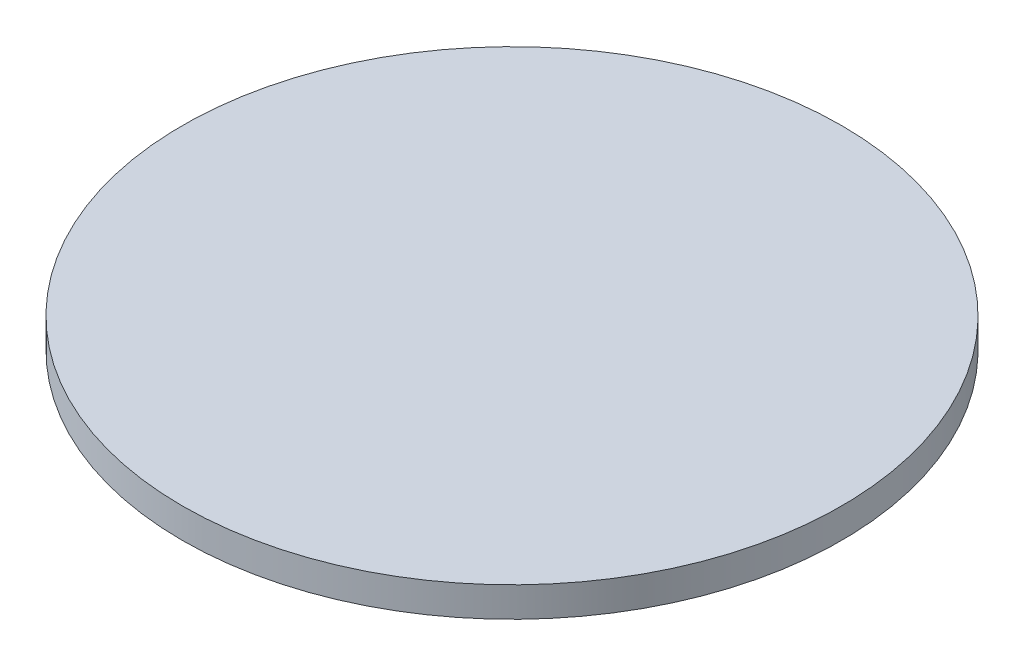
ISO-10303-21;
HEADER;
FILE_DESCRIPTION(('STEP AP214'),'2;1');
FILE_NAME('part.step','',(''),(''),'','','');
FILE_SCHEMA(('AUTOMOTIVE_DESIGN { 1 0 10303 214 1 1 1 1 }'));
ENDSEC;
DATA;
#1=APPLICATION_CONTEXT('core data for automotive mechanical design processes');
#2=APPLICATION_PROTOCOL_DEFINITION('international standard','automotive_design',2000,#1);
#3=PRODUCT_CONTEXT('',#1,'mechanical');
#4=PRODUCT('Part','Part','',(#3));
#5=PRODUCT_RELATED_PRODUCT_CATEGORY('part','',(#4));
#6=PRODUCT_DEFINITION_FORMATION('','',#4);
#7=PRODUCT_DEFINITION_CONTEXT('part definition',#1,'design');
#8=PRODUCT_DEFINITION('design','',#6,#7);
#9=PRODUCT_DEFINITION_SHAPE('','',#8);
#10=(LENGTH_UNIT() NAMED_UNIT(*) SI_UNIT(.MILLI.,.METRE.));
#11=(NAMED_UNIT(*) PLANE_ANGLE_UNIT() SI_UNIT($,.RADIAN.));
#12=(NAMED_UNIT(*) SI_UNIT($,.STERADIAN.) SOLID_ANGLE_UNIT());
#13=UNCERTAINTY_MEASURE_WITH_UNIT(LENGTH_MEASURE(1.E-05),#10,'distance_accuracy_value','');
#14=(GEOMETRIC_REPRESENTATION_CONTEXT(3) GLOBAL_UNCERTAINTY_ASSIGNED_CONTEXT((#13)) GLOBAL_UNIT_ASSIGNED_CONTEXT((#10,
#11,#12)) REPRESENTATION_CONTEXT('',''));
#15=CARTESIAN_POINT('',(0.,0.,0.));
#16=DIRECTION('',(0.,0.,1.));
#17=DIRECTION('',(1.,0.,0.));
#18=AXIS2_PLACEMENT_3D('',#15,#16,#17);
#19=CARTESIAN_POINT('',(0.,3.175,0.));
#20=DIRECTION('',(0.,-1.,0.));
#21=DIRECTION('',(0.,0.,-1.));
#22=AXIS2_PLACEMENT_3D('',#19,#20,#21);
#23=CYLINDRICAL_SURFACE('',#22,35.);
#24=CARTESIAN_POINT('',(0.,3.175,0.));
#25=DIRECTION('',(0.,1.,0.));
#26=DIRECTION('',(0.,0.,1.));
#27=AXIS2_PLACEMENT_3D('',#24,#25,#26);
#28=CIRCLE('',#27,35.);
#29=CARTESIAN_POINT('',(0.,3.175,35.));
#30=VERTEX_POINT('',#29);
#31=EDGE_CURVE('E10',#30,#30,#28,.T.);
#32=ORIENTED_EDGE('',*,*,#31,.F.);
#33=EDGE_LOOP('',(#32));
#34=FACE_BOUND('',#33,.T.);
#35=CARTESIAN_POINT('',(0.,0.,0.));
#36=DIRECTION('',(0.,1.,0.));
#37=DIRECTION('',(0.,0.,1.));
#38=AXIS2_PLACEMENT_3D('',#35,#36,#37);
#39=CIRCLE('',#38,35.);
#40=CARTESIAN_POINT('',(0.,0.,35.));
#41=VERTEX_POINT('',#40);
#42=EDGE_CURVE('E33',#41,#41,#39,.T.);
#43=ORIENTED_EDGE('',*,*,#42,.T.);
#44=EDGE_LOOP('',(#43));
#45=FACE_BOUND('',#44,.T.);
#46=ADVANCED_FACE('F30',(#34,#45),#23,.T.);
#47=CARTESIAN_POINT('',(0.,3.175,0.));
#48=DIRECTION('',(0.,1.,0.));
#49=DIRECTION('',(0.,0.,1.));
#50=AXIS2_PLACEMENT_3D('',#47,#48,#49);
#51=PLANE('',#50);
#52=ORIENTED_EDGE('',*,*,#31,.T.);
#53=EDGE_LOOP('',(#52));
#54=FACE_BOUND('',#53,.T.);
#55=ADVANCED_FACE('F45',(#54),#51,.T.);
#56=CARTESIAN_POINT('',(0.,0.,0.));
#57=DIRECTION('',(0.,1.,0.));
#58=DIRECTION('',(0.,0.,1.));
#59=AXIS2_PLACEMENT_3D('',#56,#57,#58);
#60=PLANE('',#59);
#61=ORIENTED_EDGE('',*,*,#42,.F.);
#62=EDGE_LOOP('',(#61));
#63=FACE_BOUND('',#62,.T.);
#64=ADVANCED_FACE('F43',(#63),#60,.F.);
#65=CLOSED_SHELL('',(#46,#55,#64));
#66=MANIFOLD_SOLID_BREP('B2',#65);
#67=ADVANCED_BREP_SHAPE_REPRESENTATION('',(#18,#66),#14);
#68=SHAPE_DEFINITION_REPRESENTATION(#9,#67);
ENDSEC;
END-ISO-10303-21;
